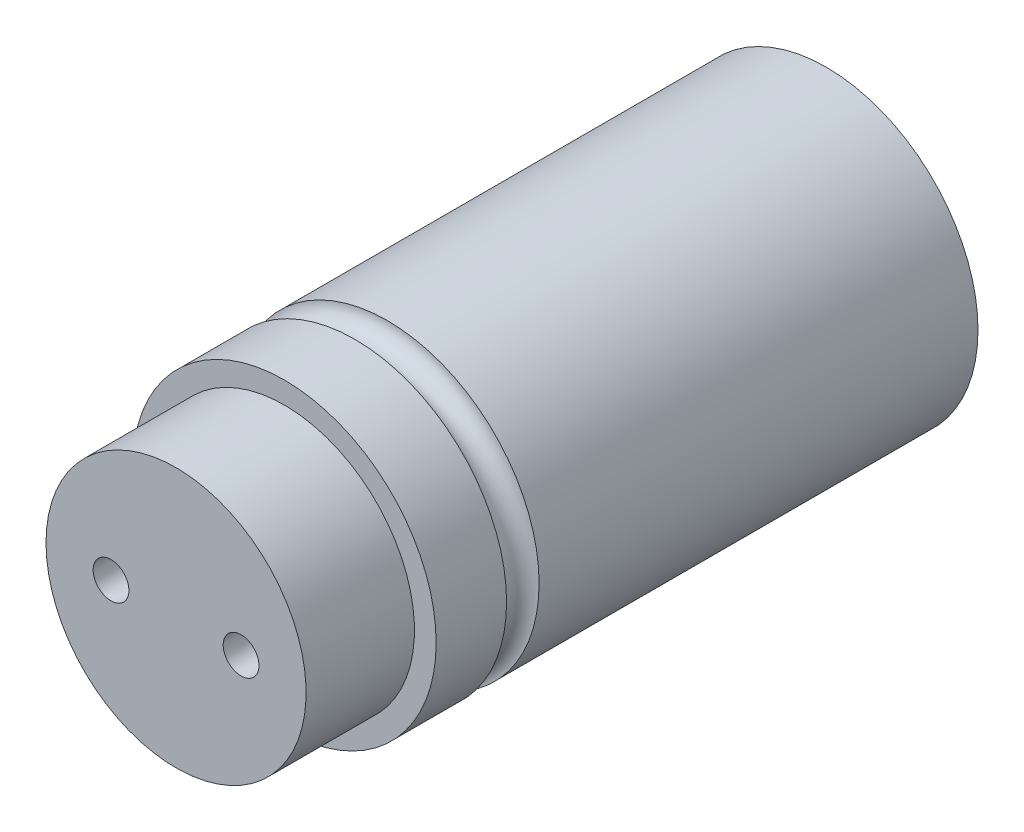
ISO-10303-21;
HEADER;
FILE_DESCRIPTION(('STEP AP214'),'2;1');
FILE_NAME('part.step','',(''),(''),'','','');
FILE_SCHEMA(('AUTOMOTIVE_DESIGN { 1 0 10303 214 1 1 1 1 }'));
ENDSEC;
DATA;
#1=APPLICATION_CONTEXT('core data for automotive mechanical design processes');
#2=APPLICATION_PROTOCOL_DEFINITION('international standard','automotive_design',2000,#1);
#3=PRODUCT_CONTEXT('',#1,'mechanical');
#4=PRODUCT('Part','Part','',(#3));
#5=PRODUCT_RELATED_PRODUCT_CATEGORY('part','',(#4));
#6=PRODUCT_DEFINITION_FORMATION('','',#4);
#7=PRODUCT_DEFINITION_CONTEXT('part definition',#1,'design');
#8=PRODUCT_DEFINITION('design','',#6,#7);
#9=PRODUCT_DEFINITION_SHAPE('','',#8);
#10=(LENGTH_UNIT() NAMED_UNIT(*) SI_UNIT(.MILLI.,.METRE.));
#11=(NAMED_UNIT(*) PLANE_ANGLE_UNIT() SI_UNIT($,.RADIAN.));
#12=(NAMED_UNIT(*) SI_UNIT($,.STERADIAN.) SOLID_ANGLE_UNIT());
#13=UNCERTAINTY_MEASURE_WITH_UNIT(LENGTH_MEASURE(1.E-05),#10,'distance_accuracy_value','');
#14=(GEOMETRIC_REPRESENTATION_CONTEXT(3) GLOBAL_UNCERTAINTY_ASSIGNED_CONTEXT((#13)) GLOBAL_UNIT_ASSIGNED_CONTEXT((#10,
#11,#12)) REPRESENTATION_CONTEXT('',''));
#15=CARTESIAN_POINT('',(0.,0.,0.));
#16=DIRECTION('',(0.,0.,1.));
#17=DIRECTION('',(1.,0.,0.));
#18=AXIS2_PLACEMENT_3D('',#15,#16,#17);
#19=CARTESIAN_POINT('',(-6.,0.,48.4999999999332));
#20=DIRECTION('',(0.,0.,1.));
#21=DIRECTION('',(0.,-1.,0.));
#22=AXIS2_PLACEMENT_3D('',#19,#20,#21);
#23=CONICAL_SURFACE('',#22,1.64999999995507,1.02974425857459);
#24=CARTESIAN_POINT('',(-6.,0.,48.5));
#25=DIRECTION('',(0.,0.,1.));
#26=DIRECTION('',(1.,0.,0.));
#27=AXIS2_PLACEMENT_3D('',#24,#25,#26);
#28=CIRCLE('',#27,1.65);
#29=CARTESIAN_POINT('',(-4.35,0.,48.5));
#30=VERTEX_POINT('',#29);
#31=EDGE_CURVE('E66',#30,#30,#28,.T.);
#32=ORIENTED_EDGE('',*,*,#31,.T.);
#33=EDGE_LOOP('',(#32));
#34=FACE_BOUND('',#33,.T.);
#35=CARTESIAN_POINT('',(-6.00000000014234,0.,47.5085799784836));
#36=VERTEX_POINT('',#35);
#37=VERTEX_LOOP('',#36);
#38=FACE_BOUND('',#37,.T.);
#39=ADVANCED_FACE('F16',(#34,#38),#23,.F.);
#40=CARTESIAN_POINT('',(6.,0.,48.4999999999332));
#41=DIRECTION('',(0.,0.,1.));
#42=DIRECTION('',(0.,-1.,0.));
#43=AXIS2_PLACEMENT_3D('',#40,#41,#42);
#44=CONICAL_SURFACE('',#43,1.64999999984184,1.02974425852921);
#45=CARTESIAN_POINT('',(6.,0.,48.5));
#46=DIRECTION('',(0.,0.,1.));
#47=DIRECTION('',(1.,0.,0.));
#48=AXIS2_PLACEMENT_3D('',#45,#46,#47);
#49=CIRCLE('',#48,1.65);
#50=CARTESIAN_POINT('',(7.65,0.,48.5));
#51=VERTEX_POINT('',#50);
#52=EDGE_CURVE('E63',#51,#51,#49,.T.);
#53=ORIENTED_EDGE('',*,*,#52,.T.);
#54=EDGE_LOOP('',(#53));
#55=FACE_BOUND('',#54,.T.);
#56=CARTESIAN_POINT('',(5.99999999980128,0.,47.508579978512));
#57=VERTEX_POINT('',#56);
#58=VERTEX_LOOP('',#57);
#59=FACE_BOUND('',#58,.T.);
#60=ADVANCED_FACE('F32',(#55,#59),#44,.F.);
#61=CARTESIAN_POINT('',(-6.,0.,60.));
#62=DIRECTION('',(0.,0.,1.));
#63=DIRECTION('',(1.,0.,0.));
#64=AXIS2_PLACEMENT_3D('',#61,#62,#63);
#65=CYLINDRICAL_SURFACE('',#64,1.65);
#66=CARTESIAN_POINT('',(-6.,0.,60.));
#67=DIRECTION('',(0.,0.,1.));
#68=DIRECTION('',(1.,0.,0.));
#69=AXIS2_PLACEMENT_3D('',#66,#67,#68);
#70=CIRCLE('',#69,1.65);
#71=CARTESIAN_POINT('',(-4.35,0.,60.));
#72=VERTEX_POINT('',#71);
#73=EDGE_CURVE('E19',#72,#72,#70,.F.);
#74=ORIENTED_EDGE('',*,*,#73,.F.);
#75=EDGE_LOOP('',(#74));
#76=FACE_BOUND('',#75,.T.);
#77=ORIENTED_EDGE('',*,*,#31,.F.);
#78=EDGE_LOOP('',(#77));
#79=FACE_BOUND('',#78,.T.);
#80=ADVANCED_FACE('F38',(#76,#79),#65,.F.);
#81=CARTESIAN_POINT('',(6.,0.,60.));
#82=DIRECTION('',(0.,0.,1.));
#83=DIRECTION('',(1.,0.,0.));
#84=AXIS2_PLACEMENT_3D('',#81,#82,#83);
#85=CYLINDRICAL_SURFACE('',#84,1.65);
#86=CARTESIAN_POINT('',(6.,0.,60.));
#87=DIRECTION('',(0.,0.,1.));
#88=DIRECTION('',(1.,0.,0.));
#89=AXIS2_PLACEMENT_3D('',#86,#87,#88);
#90=CIRCLE('',#89,1.65);
#91=CARTESIAN_POINT('',(7.65,0.,60.));
#92=VERTEX_POINT('',#91);
#93=EDGE_CURVE('E76',#92,#92,#90,.F.);
#94=ORIENTED_EDGE('',*,*,#93,.F.);
#95=EDGE_LOOP('',(#94));
#96=FACE_BOUND('',#95,.T.);
#97=ORIENTED_EDGE('',*,*,#52,.F.);
#98=EDGE_LOOP('',(#97));
#99=FACE_BOUND('',#98,.T.);
#100=ADVANCED_FACE('F88',(#96,#99),#85,.F.);
#101=CARTESIAN_POINT('',(0.,0.,60.));
#102=DIRECTION('',(0.,0.,1.));
#103=DIRECTION('',(1.,0.,0.));
#104=AXIS2_PLACEMENT_3D('',#101,#102,#103);
#105=PLANE('',#104);
#106=ORIENTED_EDGE('',*,*,#93,.T.);
#107=EDGE_LOOP('',(#106));
#108=FACE_BOUND('',#107,.T.);
#109=ORIENTED_EDGE('',*,*,#73,.T.);
#110=EDGE_LOOP('',(#109));
#111=FACE_BOUND('',#110,.T.);
#112=CARTESIAN_POINT('',(0.,0.,60.));
#113=DIRECTION('',(0.,0.,-1.));
#114=DIRECTION('',(-1.,0.,0.));
#115=AXIS2_PLACEMENT_3D('',#112,#113,#114);
#116=CIRCLE('',#115,12.);
#117=CARTESIAN_POINT('',(-12.,0.,60.));
#118=VERTEX_POINT('',#117);
#119=EDGE_CURVE('E74',#118,#118,#116,.T.);
#120=ORIENTED_EDGE('',*,*,#119,.F.);
#121=EDGE_LOOP('',(#120));
#122=FACE_BOUND('',#121,.T.);
#123=ADVANCED_FACE('F83',(#108,#111,#122),#105,.T.);
#124=CARTESIAN_POINT('',(0.,0.,60.));
#125=DIRECTION('',(0.,0.,-1.));
#126=DIRECTION('',(-1.,0.,0.));
#127=AXIS2_PLACEMENT_3D('',#124,#125,#126);
#128=CYLINDRICAL_SURFACE('',#127,12.);
#129=CARTESIAN_POINT('',(0.,0.,50.));
#130=DIRECTION('',(0.,0.,-1.));
#131=DIRECTION('',(-1.,0.,0.));
#132=AXIS2_PLACEMENT_3D('',#129,#130,#131);
#133=CIRCLE('',#132,12.);
#134=CARTESIAN_POINT('',(-12.,0.,50.));
#135=VERTEX_POINT('',#134);
#136=EDGE_CURVE('E71',#135,#135,#133,.F.);
#137=ORIENTED_EDGE('',*,*,#136,.T.);
#138=EDGE_LOOP('',(#137));
#139=FACE_BOUND('',#138,.T.);
#140=ORIENTED_EDGE('',*,*,#119,.T.);
#141=EDGE_LOOP('',(#140));
#142=FACE_BOUND('',#141,.T.);
#143=ADVANCED_FACE('F99',(#139,#142),#128,.T.);
#144=CARTESIAN_POINT('',(0.,0.,50.));
#145=DIRECTION('',(0.,0.,-1.));
#146=DIRECTION('',(-1.,0.,0.));
#147=AXIS2_PLACEMENT_3D('',#144,#145,#146);
#148=PLANE('',#147);
#149=ORIENTED_EDGE('',*,*,#136,.F.);
#150=EDGE_LOOP('',(#149));
#151=FACE_BOUND('',#150,.T.);
#152=CARTESIAN_POINT('',(0.,0.,50.));
#153=DIRECTION('',(0.,0.,-1.));
#154=DIRECTION('',(-1.,0.,0.));
#155=AXIS2_PLACEMENT_3D('',#152,#153,#154);
#156=CIRCLE('',#155,14.);
#157=CARTESIAN_POINT('',(-14.,0.,50.));
#158=VERTEX_POINT('',#157);
#159=EDGE_CURVE('E62',#158,#158,#156,.T.);
#160=ORIENTED_EDGE('',*,*,#159,.F.);
#161=EDGE_LOOP('',(#160));
#162=FACE_BOUND('',#161,.T.);
#163=ADVANCED_FACE('F102',(#151,#162),#148,.F.);
#164=CARTESIAN_POINT('',(0.,0.,50.));
#165=DIRECTION('',(0.,0.,-1.));
#166=DIRECTION('',(-1.,0.,0.));
#167=AXIS2_PLACEMENT_3D('',#164,#165,#166);
#168=CYLINDRICAL_SURFACE('',#167,14.);
#169=CARTESIAN_POINT('',(0.,0.,43.5));
#170=DIRECTION('',(0.,0.,1.));
#171=DIRECTION('',(1.,0.,0.));
#172=AXIS2_PLACEMENT_3D('',#169,#170,#171);
#173=CIRCLE('',#172,14.);
#174=CARTESIAN_POINT('',(14.,0.,43.5));
#175=VERTEX_POINT('',#174);
#176=EDGE_CURVE('E59',#175,#175,#173,.T.);
#177=ORIENTED_EDGE('',*,*,#176,.T.);
#178=EDGE_LOOP('',(#177));
#179=FACE_BOUND('',#178,.T.);
#180=ORIENTED_EDGE('',*,*,#159,.T.);
#181=EDGE_LOOP('',(#180));
#182=FACE_BOUND('',#181,.T.);
#183=ADVANCED_FACE('F105',(#179,#182),#168,.T.);
#184=CARTESIAN_POINT('',(0.,0.,0.));
#185=DIRECTION('',(0.,0.,1.));
#186=DIRECTION('',(1.,0.,0.));
#187=AXIS2_PLACEMENT_3D('',#184,#185,#186);
#188=PLANE('',#187);
#189=CARTESIAN_POINT('',(0.,0.,0.));
#190=DIRECTION('',(0.,0.,-1.));
#191=DIRECTION('',(-1.,0.,0.));
#192=AXIS2_PLACEMENT_3D('',#189,#190,#191);
#193=CIRCLE('',#192,14.);
#194=CARTESIAN_POINT('',(-14.,0.,0.));
#195=VERTEX_POINT('',#194);
#196=EDGE_CURVE('E25',#195,#195,#193,.F.);
#197=ORIENTED_EDGE('',*,*,#196,.F.);
#198=EDGE_LOOP('',(#197));
#199=FACE_BOUND('',#198,.T.);
#200=ADVANCED_FACE('F49',(#199),#188,.F.);
#201=CARTESIAN_POINT('',(0.,0.,42.));
#202=DIRECTION('',(0.,0.,1.));
#203=DIRECTION('',(1.,0.,0.));
#204=AXIS2_PLACEMENT_3D('',#201,#202,#203);
#205=TOROIDAL_SURFACE('',#204,14.,1.5);
#206=ORIENTED_EDGE('',*,*,#176,.F.);
#207=EDGE_LOOP('',(#206));
#208=FACE_BOUND('',#207,.T.);
#209=CARTESIAN_POINT('',(0.,0.,40.5));
#210=DIRECTION('',(0.,0.,-1.));
#211=DIRECTION('',(-1.,0.,0.));
#212=AXIS2_PLACEMENT_3D('',#209,#210,#211);
#213=CIRCLE('',#212,14.);
#214=CARTESIAN_POINT('',(-14.,0.,40.5));
#215=VERTEX_POINT('',#214);
#216=EDGE_CURVE('E11',#215,#215,#213,.T.);
#217=ORIENTED_EDGE('',*,*,#216,.F.);
#218=EDGE_LOOP('',(#217));
#219=FACE_BOUND('',#218,.T.);
#220=ADVANCED_FACE('F43',(#208,#219),#205,.F.);
#221=CARTESIAN_POINT('',(0.,0.,50.));
#222=DIRECTION('',(0.,0.,-1.));
#223=DIRECTION('',(-1.,0.,0.));
#224=AXIS2_PLACEMENT_3D('',#221,#222,#223);
#225=CYLINDRICAL_SURFACE('',#224,14.);
#226=ORIENTED_EDGE('',*,*,#196,.T.);
#227=EDGE_LOOP('',(#226));
#228=FACE_BOUND('',#227,.T.);
#229=ORIENTED_EDGE('',*,*,#216,.T.);
#230=EDGE_LOOP('',(#229));
#231=FACE_BOUND('',#230,.T.);
#232=ADVANCED_FACE('F41',(#228,#231),#225,.T.);
#233=CLOSED_SHELL('',(#39,#60,#80,#100,#123,#143,#163,#183,#200,#220,#232));
#234=MANIFOLD_SOLID_BREP('B1',#233);
#235=ADVANCED_BREP_SHAPE_REPRESENTATION('',(#18,#234),#14);
#236=SHAPE_DEFINITION_REPRESENTATION(#9,#235);
ENDSEC;
END-ISO-10303-21;
